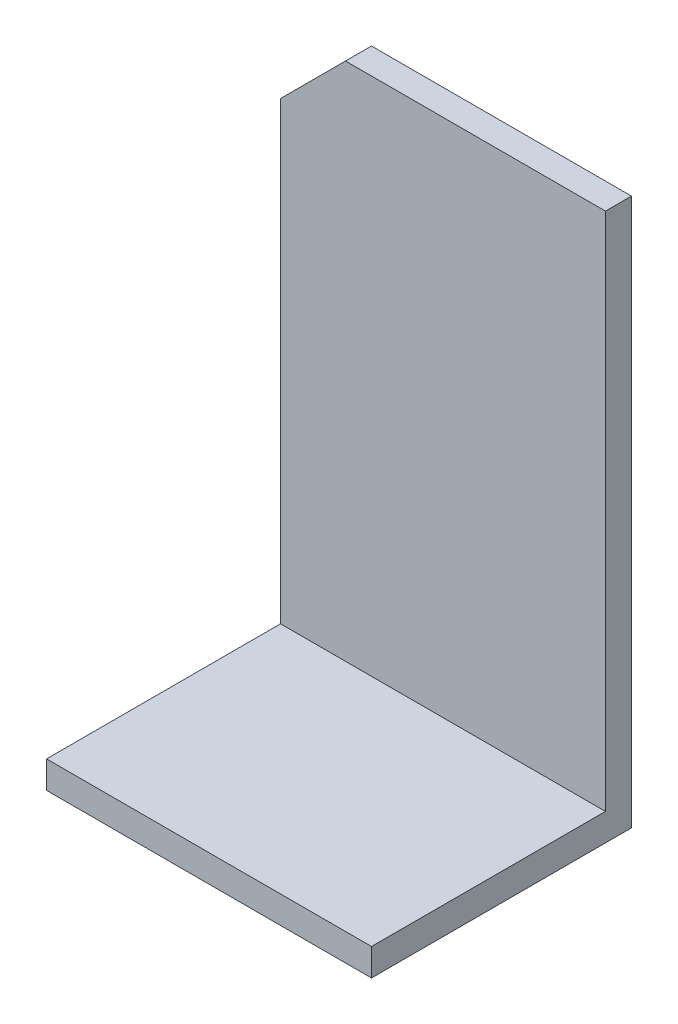
ISO-10303-21;
HEADER;
FILE_DESCRIPTION(('STEP AP214'),'2;1');
FILE_NAME('part.step','',(''),(''),'','','');
FILE_SCHEMA(('AUTOMOTIVE_DESIGN { 1 0 10303 214 1 1 1 1 }'));
ENDSEC;
DATA;
#1=APPLICATION_CONTEXT('core data for automotive mechanical design processes');
#2=APPLICATION_PROTOCOL_DEFINITION('international standard','automotive_design',2000,#1);
#3=PRODUCT_CONTEXT('',#1,'mechanical');
#4=PRODUCT('Part','Part','',(#3));
#5=PRODUCT_RELATED_PRODUCT_CATEGORY('part','',(#4));
#6=PRODUCT_DEFINITION_FORMATION('','',#4);
#7=PRODUCT_DEFINITION_CONTEXT('part definition',#1,'design');
#8=PRODUCT_DEFINITION('design','',#6,#7);
#9=PRODUCT_DEFINITION_SHAPE('','',#8);
#10=(LENGTH_UNIT() NAMED_UNIT(*) SI_UNIT(.MILLI.,.METRE.));
#11=(NAMED_UNIT(*) PLANE_ANGLE_UNIT() SI_UNIT($,.RADIAN.));
#12=(NAMED_UNIT(*) SI_UNIT($,.STERADIAN.) SOLID_ANGLE_UNIT());
#13=UNCERTAINTY_MEASURE_WITH_UNIT(LENGTH_MEASURE(1.E-05),#10,'distance_accuracy_value','');
#14=(GEOMETRIC_REPRESENTATION_CONTEXT(3) GLOBAL_UNCERTAINTY_ASSIGNED_CONTEXT((#13)) GLOBAL_UNIT_ASSIGNED_CONTEXT((#10,
#11,#12)) REPRESENTATION_CONTEXT('',''));
#15=CARTESIAN_POINT('',(0.,0.,0.));
#16=DIRECTION('',(0.,0.,1.));
#17=DIRECTION('',(1.,0.,0.));
#18=AXIS2_PLACEMENT_3D('',#15,#16,#17);
#19=CARTESIAN_POINT('',(-0.778320699595434,-1.5105,0.2));
#20=DIRECTION('',(0.,0.,1.));
#21=DIRECTION('',(0.,-1.,0.));
#22=AXIS2_PLACEMENT_3D('',#19,#20,#21);
#23=PLANE('',#22);
#24=DIRECTION('',(1.,0.,0.));
#25=VECTOR('',#24,1.);
#26=CARTESIAN_POINT('',(-0.778320699595434,-1.521,0.2));
#27=LINE('',#26,#25);
#28=CARTESIAN_POINT('',(-0.903320699595434,-1.521,0.2));
#29=VERTEX_POINT('',#28);
#30=CARTESIAN_POINT('',(-0.653320699595434,-1.521,0.2));
#31=VERTEX_POINT('',#30);
#32=EDGE_CURVE('E113',#29,#31,#27,.T.);
#33=ORIENTED_EDGE('',*,*,#32,.T.);
#34=DIRECTION('',(0.,-1.,0.));
#35=VECTOR('',#34,1.);
#36=CARTESIAN_POINT('',(-0.653320699595434,-1.36847101449276,0.2));
#37=LINE('',#36,#35);
#38=CARTESIAN_POINT('',(-0.653320699595434,-1.5,0.2));
#39=VERTEX_POINT('',#38);
#40=EDGE_CURVE('E109',#39,#31,#37,.T.);
#41=ORIENTED_EDGE('',*,*,#40,.F.);
#42=DIRECTION('',(1.,0.,0.));
#43=VECTOR('',#42,1.);
#44=CARTESIAN_POINT('',(-0.778320699595434,-1.5,0.2));
#45=LINE('',#44,#43);
#46=CARTESIAN_POINT('',(-0.903320699595434,-1.5,0.2));
#47=VERTEX_POINT('',#46);
#48=EDGE_CURVE('E11',#47,#39,#45,.T.);
#49=ORIENTED_EDGE('',*,*,#48,.F.);
#50=DIRECTION('',(0.,-1.,0.));
#51=VECTOR('',#50,1.);
#52=CARTESIAN_POINT('',(-0.903320699595434,-1.3906663747811,0.2));
#53=LINE('',#52,#51);
#54=EDGE_CURVE('E162',#47,#29,#53,.T.);
#55=ORIENTED_EDGE('',*,*,#54,.T.);
#56=EDGE_LOOP('',(#33,#41,#49,#55));
#57=FACE_BOUND('',#56,.T.);
#58=ADVANCED_FACE('F17',(#57),#23,.T.);
#59=CARTESIAN_POINT('',(-0.778320699595434,-1.5,0.11));
#60=DIRECTION('',(0.,1.,0.));
#61=DIRECTION('',(1.,0.,0.));
#62=AXIS2_PLACEMENT_3D('',#59,#60,#61);
#63=PLANE('',#62);
#64=DIRECTION('',(0.,0.,1.));
#65=VECTOR('',#64,1.);
#66=CARTESIAN_POINT('',(-0.903320699595434,-1.5,0.0448336252189149));
#67=LINE('',#66,#65);
#68=CARTESIAN_POINT('',(-0.903320699595434,-1.5,0.02));
#69=VERTEX_POINT('',#68);
#70=EDGE_CURVE('E165',#69,#47,#67,.T.);
#71=ORIENTED_EDGE('',*,*,#70,.T.);
#72=ORIENTED_EDGE('',*,*,#48,.T.);
#73=DIRECTION('',(0.,0.,1.));
#74=VECTOR('',#73,1.);
#75=CARTESIAN_POINT('',(-0.653320699595434,-1.5,0.0420289855072472));
#76=LINE('',#75,#74);
#77=CARTESIAN_POINT('',(-0.653320699595434,-1.5,0.02));
#78=VERTEX_POINT('',#77);
#79=EDGE_CURVE('E145',#78,#39,#76,.T.);
#80=ORIENTED_EDGE('',*,*,#79,.F.);
#81=DIRECTION('',(1.,0.,0.));
#82=VECTOR('',#81,1.);
#83=CARTESIAN_POINT('',(-0.775032042106288,-1.5,0.02));
#84=LINE('',#83,#82);
#85=EDGE_CURVE('E26',#69,#78,#84,.T.);
#86=ORIENTED_EDGE('',*,*,#85,.F.);
#87=EDGE_LOOP('',(#71,#72,#80,#86));
#88=FACE_BOUND('',#87,.T.);
#89=ADVANCED_FACE('F19',(#88),#63,.T.);
#90=CARTESIAN_POINT('',(-0.775032042106288,-1.3050173744811,0.02));
#91=DIRECTION('',(0.,0.,1.));
#92=DIRECTION('',(0.,-1.,0.));
#93=AXIS2_PLACEMENT_3D('',#90,#91,#92);
#94=PLANE('',#93);
#95=DIRECTION('',(-0.707106781186547,-0.707106781186548,0.));
#96=VECTOR('',#95,1.);
#97=CARTESIAN_POINT('',(-0.878320699595436,-1.12500000000002,0.02));
#98=LINE('',#97,#96);
#99=CARTESIAN_POINT('',(-0.853320699595434,-1.10000000000002,0.02));
#100=VERTEX_POINT('',#99);
#101=CARTESIAN_POINT('',(-0.903320699595434,-1.15000000000002,0.02));
#102=VERTEX_POINT('',#101);
#103=EDGE_CURVE('E39',#100,#102,#98,.T.);
#104=ORIENTED_EDGE('',*,*,#103,.T.);
#105=DIRECTION('',(0.,-1.,0.));
#106=VECTOR('',#105,1.);
#107=CARTESIAN_POINT('',(-0.903320699595434,-1.3906663747811,0.02));
#108=LINE('',#107,#106);
#109=EDGE_CURVE('E174',#102,#69,#108,.T.);
#110=ORIENTED_EDGE('',*,*,#109,.T.);
#111=ORIENTED_EDGE('',*,*,#85,.T.);
#112=DIRECTION('',(0.,-1.,0.));
#113=VECTOR('',#112,1.);
#114=CARTESIAN_POINT('',(-0.653320699595434,-1.36847101449276,0.02));
#115=LINE('',#114,#113);
#116=CARTESIAN_POINT('',(-0.653320699595434,-1.10000000000002,0.02));
#117=VERTEX_POINT('',#116);
#118=EDGE_CURVE('E161',#117,#78,#115,.T.);
#119=ORIENTED_EDGE('',*,*,#118,.F.);
#120=DIRECTION('',(1.,0.,0.));
#121=VECTOR('',#120,1.);
#122=CARTESIAN_POINT('',(-0.753320699595435,-1.10000000000002,0.02));
#123=LINE('',#122,#121);
#124=EDGE_CURVE('E157',#100,#117,#123,.T.);
#125=ORIENTED_EDGE('',*,*,#124,.F.);
#126=EDGE_LOOP('',(#104,#110,#111,#119,#125));
#127=FACE_BOUND('',#126,.T.);
#128=ADVANCED_FACE('F184',(#127),#94,.T.);
#129=CARTESIAN_POINT('',(-0.878320699595436,-1.12500000000002,0.01));
#130=DIRECTION('',(0.707106781186548,-0.707106781186547,0.));
#131=DIRECTION('',(0.,0.,-1.));
#132=AXIS2_PLACEMENT_3D('',#129,#130,#131);
#133=PLANE('',#132);
#134=DIRECTION('',(0.,0.,1.));
#135=VECTOR('',#134,1.);
#136=CARTESIAN_POINT('',(-0.903320699595434,-1.15000000000002,0.0448336252189149));
#137=LINE('',#136,#135);
#138=CARTESIAN_POINT('',(-0.903320699595434,-1.15000000000002,0.));
#139=VERTEX_POINT('',#138);
#140=EDGE_CURVE('E177',#139,#102,#137,.T.);
#141=ORIENTED_EDGE('',*,*,#140,.T.);
#142=ORIENTED_EDGE('',*,*,#103,.F.);
#143=DIRECTION('',(0.,0.,1.));
#144=VECTOR('',#143,1.);
#145=CARTESIAN_POINT('',(-0.853320699595434,-1.10000000000002,0.01));
#146=LINE('',#145,#144);
#147=CARTESIAN_POINT('',(-0.853320699595434,-1.10000000000002,0.));
#148=VERTEX_POINT('',#147);
#149=EDGE_CURVE('E153',#148,#100,#146,.T.);
#150=ORIENTED_EDGE('',*,*,#149,.F.);
#151=DIRECTION('',(-0.707106781186545,-0.70710678118655,0.));
#152=VECTOR('',#151,1.);
#153=CARTESIAN_POINT('',(-0.853320699595434,-1.10000000000002,0.));
#154=LINE('',#153,#152);
#155=EDGE_CURVE('E139',#148,#139,#154,.T.);
#156=ORIENTED_EDGE('',*,*,#155,.T.);
#157=EDGE_LOOP('',(#141,#142,#150,#156));
#158=FACE_BOUND('',#157,.T.);
#159=ADVANCED_FACE('F190',(#158),#133,.F.);
#160=CARTESIAN_POINT('',(-0.903320699595434,-1.3906663747811,0.0448336252189149));
#161=DIRECTION('',(1.,0.,0.));
#162=DIRECTION('',(0.,-1.,0.));
#163=AXIS2_PLACEMENT_3D('',#160,#161,#162);
#164=PLANE('',#163);
#165=DIRECTION('',(0.,0.,1.));
#166=VECTOR('',#165,1.);
#167=CARTESIAN_POINT('',(-0.903320699595434,-1.521,0.0999999999999988));
#168=LINE('',#167,#166);
#169=CARTESIAN_POINT('',(-0.903320699595434,-1.521,0.));
#170=VERTEX_POINT('',#169);
#171=EDGE_CURVE('E119',#170,#29,#168,.T.);
#172=ORIENTED_EDGE('',*,*,#171,.T.);
#173=ORIENTED_EDGE('',*,*,#54,.F.);
#174=ORIENTED_EDGE('',*,*,#70,.F.);
#175=ORIENTED_EDGE('',*,*,#109,.F.);
#176=ORIENTED_EDGE('',*,*,#140,.F.);
#177=DIRECTION('',(0.,-1.,0.));
#178=VECTOR('',#177,1.);
#179=CARTESIAN_POINT('',(-0.903320699595434,-1.31559112123517,0.));
#180=LINE('',#179,#178);
#181=EDGE_CURVE('E124',#139,#170,#180,.T.);
#182=ORIENTED_EDGE('',*,*,#181,.T.);
#183=EDGE_LOOP('',(#172,#173,#174,#175,#176,#182));
#184=FACE_BOUND('',#183,.T.);
#185=ADVANCED_FACE('F192',(#184),#164,.F.);
#186=CARTESIAN_POINT('',(-0.778320699595434,-1.521,0.0999999999999988));
#187=DIRECTION('',(0.,1.,0.));
#188=DIRECTION('',(1.,0.,0.));
#189=AXIS2_PLACEMENT_3D('',#186,#187,#188);
#190=PLANE('',#189);
#191=DIRECTION('',(1.,0.,0.));
#192=VECTOR('',#191,1.);
#193=CARTESIAN_POINT('',(-0.775137262256353,-1.521,0.));
#194=LINE('',#193,#192);
#195=CARTESIAN_POINT('',(-0.653320699595434,-1.521,0.));
#196=VERTEX_POINT('',#195);
#197=EDGE_CURVE('E116',#170,#196,#194,.T.);
#198=ORIENTED_EDGE('',*,*,#197,.T.);
#199=DIRECTION('',(0.,0.,-1.));
#200=VECTOR('',#199,1.);
#201=CARTESIAN_POINT('',(-0.653320699595434,-1.521,0.0420289855072472));
#202=LINE('',#201,#200);
#203=EDGE_CURVE('E100',#31,#196,#202,.T.);
#204=ORIENTED_EDGE('',*,*,#203,.F.);
#205=ORIENTED_EDGE('',*,*,#32,.F.);
#206=ORIENTED_EDGE('',*,*,#171,.F.);
#207=EDGE_LOOP('',(#198,#204,#205,#206));
#208=FACE_BOUND('',#207,.T.);
#209=ADVANCED_FACE('F117',(#208),#190,.F.);
#210=CARTESIAN_POINT('',(-0.653320699595434,-1.36847101449276,0.0420289855072472));
#211=DIRECTION('',(1.,0.,0.));
#212=DIRECTION('',(0.,-1.,0.));
#213=AXIS2_PLACEMENT_3D('',#210,#211,#212);
#214=PLANE('',#213);
#215=ORIENTED_EDGE('',*,*,#118,.T.);
#216=ORIENTED_EDGE('',*,*,#79,.T.);
#217=ORIENTED_EDGE('',*,*,#40,.T.);
#218=ORIENTED_EDGE('',*,*,#203,.T.);
#219=DIRECTION('',(0.,1.,0.));
#220=VECTOR('',#219,1.);
#221=CARTESIAN_POINT('',(-0.653320699595434,-1.31559112123517,0.));
#222=LINE('',#221,#220);
#223=CARTESIAN_POINT('',(-0.653320699595434,-1.10000000000002,0.));
#224=VERTEX_POINT('',#223);
#225=EDGE_CURVE('E106',#196,#224,#222,.T.);
#226=ORIENTED_EDGE('',*,*,#225,.T.);
#227=DIRECTION('',(0.,0.,-1.));
#228=VECTOR('',#227,1.);
#229=CARTESIAN_POINT('',(-0.653320699595434,-1.10000000000002,0.01));
#230=LINE('',#229,#228);
#231=EDGE_CURVE('E148',#117,#224,#230,.T.);
#232=ORIENTED_EDGE('',*,*,#231,.F.);
#233=EDGE_LOOP('',(#215,#216,#217,#218,#226,#232));
#234=FACE_BOUND('',#233,.T.);
#235=ADVANCED_FACE('F103',(#234),#214,.T.);
#236=CARTESIAN_POINT('',(-0.753320699595435,-1.10000000000002,0.01));
#237=DIRECTION('',(0.,1.,0.));
#238=DIRECTION('',(0.,0.,-1.));
#239=AXIS2_PLACEMENT_3D('',#236,#237,#238);
#240=PLANE('',#239);
#241=ORIENTED_EDGE('',*,*,#231,.T.);
#242=DIRECTION('',(-1.,0.,0.));
#243=VECTOR('',#242,1.);
#244=CARTESIAN_POINT('',(-0.775137262256353,-1.10000000000002,0.));
#245=LINE('',#244,#243);
#246=EDGE_CURVE('E130',#224,#148,#245,.T.);
#247=ORIENTED_EDGE('',*,*,#246,.T.);
#248=ORIENTED_EDGE('',*,*,#149,.T.);
#249=ORIENTED_EDGE('',*,*,#124,.T.);
#250=EDGE_LOOP('',(#241,#247,#248,#249));
#251=FACE_BOUND('',#250,.T.);
#252=ADVANCED_FACE('F188',(#251),#240,.T.);
#253=CARTESIAN_POINT('',(-0.775137262256353,-1.31559112123517,0.));
#254=DIRECTION('',(0.,0.,1.));
#255=DIRECTION('',(0.,-1.,0.));
#256=AXIS2_PLACEMENT_3D('',#253,#254,#255);
#257=PLANE('',#256);
#258=ORIENTED_EDGE('',*,*,#225,.F.);
#259=ORIENTED_EDGE('',*,*,#197,.F.);
#260=ORIENTED_EDGE('',*,*,#181,.F.);
#261=ORIENTED_EDGE('',*,*,#155,.F.);
#262=ORIENTED_EDGE('',*,*,#246,.F.);
#263=EDGE_LOOP('',(#258,#259,#260,#261,#262));
#264=FACE_BOUND('',#263,.T.);
#265=ADVANCED_FACE('F127',(#264),#257,.F.);
#266=CLOSED_SHELL('',(#58,#89,#128,#159,#185,#209,#235,#252,#265));
#267=MANIFOLD_SOLID_BREP('B1',#266);
#268=ADVANCED_BREP_SHAPE_REPRESENTATION('',(#18,#267),#14);
#269=SHAPE_DEFINITION_REPRESENTATION(#9,#268);
ENDSEC;
END-ISO-10303-21;
